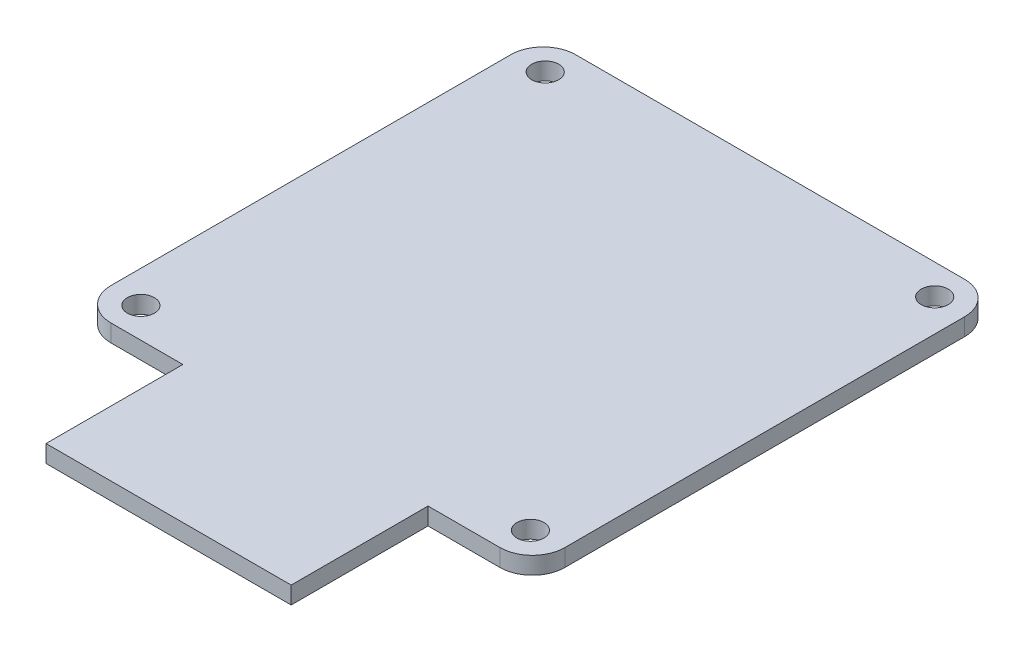
ISO-10303-21;
HEADER;
FILE_DESCRIPTION(('STEP AP214'),'2;1');
FILE_NAME('part.step','',(''),(''),'','','');
FILE_SCHEMA(('AUTOMOTIVE_DESIGN { 1 0 10303 214 1 1 1 1 }'));
ENDSEC;
DATA;
#1=APPLICATION_CONTEXT('core data for automotive mechanical design processes');
#2=APPLICATION_PROTOCOL_DEFINITION('international standard','automotive_design',2000,#1);
#3=PRODUCT_CONTEXT('',#1,'mechanical');
#4=PRODUCT('Part','Part','',(#3));
#5=PRODUCT_RELATED_PRODUCT_CATEGORY('part','',(#4));
#6=PRODUCT_DEFINITION_FORMATION('','',#4);
#7=PRODUCT_DEFINITION_CONTEXT('part definition',#1,'design');
#8=PRODUCT_DEFINITION('design','',#6,#7);
#9=PRODUCT_DEFINITION_SHAPE('','',#8);
#10=(LENGTH_UNIT() NAMED_UNIT(*) SI_UNIT(.MILLI.,.METRE.));
#11=(NAMED_UNIT(*) PLANE_ANGLE_UNIT() SI_UNIT($,.RADIAN.));
#12=(NAMED_UNIT(*) SI_UNIT($,.STERADIAN.) SOLID_ANGLE_UNIT());
#13=UNCERTAINTY_MEASURE_WITH_UNIT(LENGTH_MEASURE(1.E-05),#10,'distance_accuracy_value','');
#14=(GEOMETRIC_REPRESENTATION_CONTEXT(3) GLOBAL_UNCERTAINTY_ASSIGNED_CONTEXT((#13)) GLOBAL_UNIT_ASSIGNED_CONTEXT((#10,
#11,#12)) REPRESENTATION_CONTEXT('',''));
#15=CARTESIAN_POINT('',(0.,0.,0.));
#16=DIRECTION('',(0.,0.,1.));
#17=DIRECTION('',(1.,0.,0.));
#18=AXIS2_PLACEMENT_3D('',#15,#16,#17);
#19=CARTESIAN_POINT('',(0.,1.6,-21.5));
#20=DIRECTION('',(0.,0.,-1.));
#21=DIRECTION('',(-1.,0.,0.));
#22=AXIS2_PLACEMENT_3D('',#19,#20,#21);
#23=PLANE('',#22);
#24=DIRECTION('',(1.,0.,0.));
#25=VECTOR('',#24,1.);
#26=CARTESIAN_POINT('',(0.,0.,-21.5));
#27=LINE('',#26,#25);
#28=CARTESIAN_POINT('',(-18.,0.,-21.5));
#29=VERTEX_POINT('',#28);
#30=CARTESIAN_POINT('',(18.,0.,-21.5));
#31=VERTEX_POINT('',#30);
#32=EDGE_CURVE('E167',#29,#31,#27,.T.);
#33=ORIENTED_EDGE('',*,*,#32,.F.);
#34=DIRECTION('',(0.,-1.,0.));
#35=VECTOR('',#34,1.);
#36=CARTESIAN_POINT('',(-18.,1.6,-21.5));
#37=LINE('',#36,#35);
#38=CARTESIAN_POINT('',(-18.,1.6,-21.5));
#39=VERTEX_POINT('',#38);
#40=EDGE_CURVE('E11',#39,#29,#37,.T.);
#41=ORIENTED_EDGE('',*,*,#40,.F.);
#42=DIRECTION('',(1.,0.,0.));
#43=VECTOR('',#42,1.);
#44=CARTESIAN_POINT('',(0.,1.6,-21.5));
#45=LINE('',#44,#43);
#46=CARTESIAN_POINT('',(18.,1.6,-21.5));
#47=VERTEX_POINT('',#46);
#48=EDGE_CURVE('E440',#39,#47,#45,.T.);
#49=ORIENTED_EDGE('',*,*,#48,.T.);
#50=DIRECTION('',(0.,-1.,0.));
#51=VECTOR('',#50,1.);
#52=CARTESIAN_POINT('',(18.,1.6,-21.5));
#53=LINE('',#52,#51);
#54=EDGE_CURVE('E53',#47,#31,#53,.T.);
#55=ORIENTED_EDGE('',*,*,#54,.T.);
#56=EDGE_LOOP('',(#33,#41,#49,#55));
#57=FACE_BOUND('',#56,.T.);
#58=ADVANCED_FACE('F36',(#57),#23,.T.);
#59=CARTESIAN_POINT('',(-18.,1.6,-18.5));
#60=DIRECTION('',(0.,-1.,0.));
#61=DIRECTION('',(0.,0.,-1.));
#62=AXIS2_PLACEMENT_3D('',#59,#60,#61);
#63=CYLINDRICAL_SURFACE('',#62,3.);
#64=CARTESIAN_POINT('',(-18.,0.,-18.5));
#65=DIRECTION('',(0.,1.,0.));
#66=DIRECTION('',(0.,0.,1.));
#67=AXIS2_PLACEMENT_3D('',#64,#65,#66);
#68=CIRCLE('',#67,3.);
#69=CARTESIAN_POINT('',(-21.,0.,-18.5));
#70=VERTEX_POINT('',#69);
#71=EDGE_CURVE('E169',#29,#70,#68,.T.);
#72=ORIENTED_EDGE('',*,*,#71,.T.);
#73=DIRECTION('',(0.,-1.,0.));
#74=VECTOR('',#73,1.);
#75=CARTESIAN_POINT('',(-21.,1.6,-18.5));
#76=LINE('',#75,#74);
#77=CARTESIAN_POINT('',(-21.,1.6,-18.5));
#78=VERTEX_POINT('',#77);
#79=EDGE_CURVE('E45',#78,#70,#76,.T.);
#80=ORIENTED_EDGE('',*,*,#79,.F.);
#81=CARTESIAN_POINT('',(-18.,1.6,-18.5));
#82=DIRECTION('',(0.,1.,0.));
#83=DIRECTION('',(0.,0.,1.));
#84=AXIS2_PLACEMENT_3D('',#81,#82,#83);
#85=CIRCLE('',#84,3.);
#86=EDGE_CURVE('E438',#39,#78,#85,.T.);
#87=ORIENTED_EDGE('',*,*,#86,.F.);
#88=ORIENTED_EDGE('',*,*,#40,.T.);
#89=EDGE_LOOP('',(#72,#80,#87,#88));
#90=FACE_BOUND('',#89,.T.);
#91=ADVANCED_FACE('F226',(#90),#63,.T.);
#92=CARTESIAN_POINT('',(-21.,1.6,0.));
#93=DIRECTION('',(1.,0.,0.));
#94=DIRECTION('',(0.,0.,-1.));
#95=AXIS2_PLACEMENT_3D('',#92,#93,#94);
#96=PLANE('',#95);
#97=DIRECTION('',(0.,0.,1.));
#98=VECTOR('',#97,1.);
#99=CARTESIAN_POINT('',(-21.,0.,0.));
#100=LINE('',#99,#98);
#101=CARTESIAN_POINT('',(-21.,0.,18.5));
#102=VERTEX_POINT('',#101);
#103=EDGE_CURVE('E172',#70,#102,#100,.T.);
#104=ORIENTED_EDGE('',*,*,#103,.T.);
#105=DIRECTION('',(0.,-1.,0.));
#106=VECTOR('',#105,1.);
#107=CARTESIAN_POINT('',(-21.,1.6,18.5));
#108=LINE('',#107,#106);
#109=CARTESIAN_POINT('',(-21.,1.6,18.5));
#110=VERTEX_POINT('',#109);
#111=EDGE_CURVE('E214',#110,#102,#108,.T.);
#112=ORIENTED_EDGE('',*,*,#111,.F.);
#113=DIRECTION('',(0.,0.,1.));
#114=VECTOR('',#113,1.);
#115=CARTESIAN_POINT('',(-21.,1.6,0.));
#116=LINE('',#115,#114);
#117=EDGE_CURVE('E222',#78,#110,#116,.T.);
#118=ORIENTED_EDGE('',*,*,#117,.F.);
#119=ORIENTED_EDGE('',*,*,#79,.T.);
#120=EDGE_LOOP('',(#104,#112,#118,#119));
#121=FACE_BOUND('',#120,.T.);
#122=ADVANCED_FACE('F219',(#121),#96,.F.);
#123=CARTESIAN_POINT('',(-18.,1.6,18.5));
#124=DIRECTION('',(0.,-1.,0.));
#125=DIRECTION('',(0.,0.,-1.));
#126=AXIS2_PLACEMENT_3D('',#123,#124,#125);
#127=CYLINDRICAL_SURFACE('',#126,3.);
#128=CARTESIAN_POINT('',(-18.,0.,18.5));
#129=DIRECTION('',(0.,1.,0.));
#130=DIRECTION('',(0.,0.,1.));
#131=AXIS2_PLACEMENT_3D('',#128,#129,#130);
#132=CIRCLE('',#131,3.);
#133=CARTESIAN_POINT('',(-18.,0.,21.5));
#134=VERTEX_POINT('',#133);
#135=EDGE_CURVE('E175',#102,#134,#132,.T.);
#136=ORIENTED_EDGE('',*,*,#135,.T.);
#137=DIRECTION('',(0.,-1.,0.));
#138=VECTOR('',#137,1.);
#139=CARTESIAN_POINT('',(-18.,1.6,21.5));
#140=LINE('',#139,#138);
#141=CARTESIAN_POINT('',(-18.,1.6,21.5));
#142=VERTEX_POINT('',#141);
#143=EDGE_CURVE('E211',#142,#134,#140,.T.);
#144=ORIENTED_EDGE('',*,*,#143,.F.);
#145=CARTESIAN_POINT('',(-18.,1.6,18.5));
#146=DIRECTION('',(0.,1.,0.));
#147=DIRECTION('',(0.,0.,1.));
#148=AXIS2_PLACEMENT_3D('',#145,#146,#147);
#149=CIRCLE('',#148,3.);
#150=EDGE_CURVE('E426',#110,#142,#149,.T.);
#151=ORIENTED_EDGE('',*,*,#150,.F.);
#152=ORIENTED_EDGE('',*,*,#111,.T.);
#153=EDGE_LOOP('',(#136,#144,#151,#152));
#154=FACE_BOUND('',#153,.T.);
#155=ADVANCED_FACE('F296',(#154),#127,.T.);
#156=CARTESIAN_POINT('',(0.,1.6,21.5));
#157=DIRECTION('',(0.,0.,-1.));
#158=DIRECTION('',(-1.,0.,0.));
#159=AXIS2_PLACEMENT_3D('',#156,#157,#158);
#160=PLANE('',#159);
#161=DIRECTION('',(1.,0.,0.));
#162=VECTOR('',#161,1.);
#163=CARTESIAN_POINT('',(0.,0.,21.5));
#164=LINE('',#163,#162);
#165=CARTESIAN_POINT('',(-11.3434224779368,0.,21.5));
#166=VERTEX_POINT('',#165);
#167=EDGE_CURVE('E178',#134,#166,#164,.T.);
#168=ORIENTED_EDGE('',*,*,#167,.T.);
#169=DIRECTION('',(0.,-1.,0.));
#170=VECTOR('',#169,1.);
#171=CARTESIAN_POINT('',(-11.3434224779368,1.6,21.5));
#172=LINE('',#171,#170);
#173=CARTESIAN_POINT('',(-11.3434224779368,1.6,21.5));
#174=VERTEX_POINT('',#173);
#175=EDGE_CURVE('E208',#174,#166,#172,.T.);
#176=ORIENTED_EDGE('',*,*,#175,.F.);
#177=DIRECTION('',(1.,0.,0.));
#178=VECTOR('',#177,1.);
#179=CARTESIAN_POINT('',(0.,1.6,21.5));
#180=LINE('',#179,#178);
#181=EDGE_CURVE('E423',#142,#174,#180,.T.);
#182=ORIENTED_EDGE('',*,*,#181,.F.);
#183=ORIENTED_EDGE('',*,*,#143,.T.);
#184=EDGE_LOOP('',(#168,#176,#182,#183));
#185=FACE_BOUND('',#184,.T.);
#186=ADVANCED_FACE('F284',(#185),#160,.F.);
#187=CARTESIAN_POINT('',(-11.3434224779368,1.6,0.));
#188=DIRECTION('',(1.,0.,0.));
#189=DIRECTION('',(0.,0.,-1.));
#190=AXIS2_PLACEMENT_3D('',#187,#188,#189);
#191=PLANE('',#190);
#192=DIRECTION('',(0.,0.,1.));
#193=VECTOR('',#192,1.);
#194=CARTESIAN_POINT('',(-11.3434224779368,0.,0.));
#195=LINE('',#194,#193);
#196=CARTESIAN_POINT('',(-11.3434224779368,0.,34.1661640587151));
#197=VERTEX_POINT('',#196);
#198=EDGE_CURVE('E181',#166,#197,#195,.T.);
#199=ORIENTED_EDGE('',*,*,#198,.T.);
#200=DIRECTION('',(0.,-1.,0.));
#201=VECTOR('',#200,1.);
#202=CARTESIAN_POINT('',(-11.3434224779368,1.6,34.1661640587151));
#203=LINE('',#202,#201);
#204=CARTESIAN_POINT('',(-11.3434224779368,1.6,34.1661640587151));
#205=VERTEX_POINT('',#204);
#206=EDGE_CURVE('E205',#205,#197,#203,.T.);
#207=ORIENTED_EDGE('',*,*,#206,.F.);
#208=DIRECTION('',(0.,0.,1.));
#209=VECTOR('',#208,1.);
#210=CARTESIAN_POINT('',(-11.3434224779368,1.6,0.));
#211=LINE('',#210,#209);
#212=EDGE_CURVE('E420',#174,#205,#211,.T.);
#213=ORIENTED_EDGE('',*,*,#212,.F.);
#214=ORIENTED_EDGE('',*,*,#175,.T.);
#215=EDGE_LOOP('',(#199,#207,#213,#214));
#216=FACE_BOUND('',#215,.T.);
#217=ADVANCED_FACE('F291',(#216),#191,.F.);
#218=CARTESIAN_POINT('',(0.,1.6,34.1661640587151));
#219=DIRECTION('',(0.,0.,-1.));
#220=DIRECTION('',(-1.,0.,0.));
#221=AXIS2_PLACEMENT_3D('',#218,#219,#220);
#222=PLANE('',#221);
#223=DIRECTION('',(1.,0.,0.));
#224=VECTOR('',#223,1.);
#225=CARTESIAN_POINT('',(0.,0.,34.1661640587151));
#226=LINE('',#225,#224);
#227=CARTESIAN_POINT('',(11.3434224779368,0.,34.1661640587151));
#228=VERTEX_POINT('',#227);
#229=EDGE_CURVE('E185',#197,#228,#226,.T.);
#230=ORIENTED_EDGE('',*,*,#229,.T.);
#231=DIRECTION('',(0.,-1.,0.));
#232=VECTOR('',#231,1.);
#233=CARTESIAN_POINT('',(11.3434224779368,1.6,34.1661640587151));
#234=LINE('',#233,#232);
#235=CARTESIAN_POINT('',(11.3434224779368,1.6,34.1661640587151));
#236=VERTEX_POINT('',#235);
#237=EDGE_CURVE('E203',#236,#228,#234,.T.);
#238=ORIENTED_EDGE('',*,*,#237,.F.);
#239=DIRECTION('',(1.,0.,0.));
#240=VECTOR('',#239,1.);
#241=CARTESIAN_POINT('',(0.,1.6,34.1661640587151));
#242=LINE('',#241,#240);
#243=EDGE_CURVE('E422',#205,#236,#242,.T.);
#244=ORIENTED_EDGE('',*,*,#243,.F.);
#245=ORIENTED_EDGE('',*,*,#206,.T.);
#246=EDGE_LOOP('',(#230,#238,#244,#245));
#247=FACE_BOUND('',#246,.T.);
#248=ADVANCED_FACE('F287',(#247),#222,.F.);
#249=CARTESIAN_POINT('',(11.3434224779368,1.6,0.));
#250=DIRECTION('',(1.,0.,0.));
#251=DIRECTION('',(0.,0.,-1.));
#252=AXIS2_PLACEMENT_3D('',#249,#250,#251);
#253=PLANE('',#252);
#254=DIRECTION('',(0.,0.,1.));
#255=VECTOR('',#254,1.);
#256=CARTESIAN_POINT('',(11.3434224779368,0.,0.));
#257=LINE('',#256,#255);
#258=CARTESIAN_POINT('',(11.3434224779368,0.,21.5));
#259=VERTEX_POINT('',#258);
#260=EDGE_CURVE('E188',#259,#228,#257,.T.);
#261=ORIENTED_EDGE('',*,*,#260,.F.);
#262=DIRECTION('',(0.,-1.,0.));
#263=VECTOR('',#262,1.);
#264=CARTESIAN_POINT('',(11.3434224779368,1.6,21.5));
#265=LINE('',#264,#263);
#266=CARTESIAN_POINT('',(11.3434224779368,1.6,21.5));
#267=VERTEX_POINT('',#266);
#268=EDGE_CURVE('E201',#267,#259,#265,.T.);
#269=ORIENTED_EDGE('',*,*,#268,.F.);
#270=DIRECTION('',(0.,0.,1.));
#271=VECTOR('',#270,1.);
#272=CARTESIAN_POINT('',(11.3434224779368,1.6,0.));
#273=LINE('',#272,#271);
#274=EDGE_CURVE('E429',#267,#236,#273,.T.);
#275=ORIENTED_EDGE('',*,*,#274,.T.);
#276=ORIENTED_EDGE('',*,*,#237,.T.);
#277=EDGE_LOOP('',(#261,#269,#275,#276));
#278=FACE_BOUND('',#277,.T.);
#279=ADVANCED_FACE('F282',(#278),#253,.T.);
#280=CARTESIAN_POINT('',(18.,0.,21.5));
#281=VERTEX_POINT('',#280);
#282=EDGE_CURVE('E182',#259,#281,#164,.T.);
#283=ORIENTED_EDGE('',*,*,#282,.T.);
#284=DIRECTION('',(0.,-1.,0.));
#285=VECTOR('',#284,1.);
#286=CARTESIAN_POINT('',(18.,1.6,21.5));
#287=LINE('',#286,#285);
#288=CARTESIAN_POINT('',(18.,1.6,21.5));
#289=VERTEX_POINT('',#288);
#290=EDGE_CURVE('E147',#289,#281,#287,.T.);
#291=ORIENTED_EDGE('',*,*,#290,.F.);
#292=EDGE_CURVE('E136',#267,#289,#180,.T.);
#293=ORIENTED_EDGE('',*,*,#292,.F.);
#294=ORIENTED_EDGE('',*,*,#268,.T.);
#295=EDGE_LOOP('',(#283,#291,#293,#294));
#296=FACE_BOUND('',#295,.T.);
#297=ADVANCED_FACE('F279',(#296),#160,.F.);
#298=CARTESIAN_POINT('',(18.,1.6,18.5));
#299=DIRECTION('',(0.,-1.,0.));
#300=DIRECTION('',(0.,0.,-1.));
#301=AXIS2_PLACEMENT_3D('',#298,#299,#300);
#302=CYLINDRICAL_SURFACE('',#301,3.);
#303=CARTESIAN_POINT('',(18.,0.,18.5));
#304=DIRECTION('',(0.,1.,0.));
#305=DIRECTION('',(0.,0.,1.));
#306=AXIS2_PLACEMENT_3D('',#303,#304,#305);
#307=CIRCLE('',#306,3.);
#308=CARTESIAN_POINT('',(21.,0.,18.5));
#309=VERTEX_POINT('',#308);
#310=EDGE_CURVE('E144',#281,#309,#307,.T.);
#311=ORIENTED_EDGE('',*,*,#310,.T.);
#312=DIRECTION('',(0.,-1.,0.));
#313=VECTOR('',#312,1.);
#314=CARTESIAN_POINT('',(21.,1.6,18.5));
#315=LINE('',#314,#313);
#316=CARTESIAN_POINT('',(21.,1.6,18.5));
#317=VERTEX_POINT('',#316);
#318=EDGE_CURVE('E142',#317,#309,#315,.T.);
#319=ORIENTED_EDGE('',*,*,#318,.F.);
#320=CARTESIAN_POINT('',(18.,1.6,18.5));
#321=DIRECTION('',(0.,1.,0.));
#322=DIRECTION('',(0.,0.,1.));
#323=AXIS2_PLACEMENT_3D('',#320,#321,#322);
#324=CIRCLE('',#323,3.);
#325=EDGE_CURVE('E127',#289,#317,#324,.T.);
#326=ORIENTED_EDGE('',*,*,#325,.F.);
#327=ORIENTED_EDGE('',*,*,#290,.T.);
#328=EDGE_LOOP('',(#311,#319,#326,#327));
#329=FACE_BOUND('',#328,.T.);
#330=ADVANCED_FACE('F143',(#329),#302,.T.);
#331=CARTESIAN_POINT('',(21.,1.6,0.));
#332=DIRECTION('',(1.,0.,0.));
#333=DIRECTION('',(0.,0.,-1.));
#334=AXIS2_PLACEMENT_3D('',#331,#332,#333);
#335=PLANE('',#334);
#336=DIRECTION('',(0.,0.,1.));
#337=VECTOR('',#336,1.);
#338=CARTESIAN_POINT('',(21.,0.,0.));
#339=LINE('',#338,#337);
#340=CARTESIAN_POINT('',(21.,0.,-18.5));
#341=VERTEX_POINT('',#340);
#342=EDGE_CURVE('E192',#341,#309,#339,.T.);
#343=ORIENTED_EDGE('',*,*,#342,.F.);
#344=DIRECTION('',(0.,-1.,0.));
#345=VECTOR('',#344,1.);
#346=CARTESIAN_POINT('',(21.,1.6,-18.5));
#347=LINE('',#346,#345);
#348=CARTESIAN_POINT('',(21.,1.6,-18.5));
#349=VERTEX_POINT('',#348);
#350=EDGE_CURVE('E90',#349,#341,#347,.T.);
#351=ORIENTED_EDGE('',*,*,#350,.F.);
#352=DIRECTION('',(0.,0.,1.));
#353=VECTOR('',#352,1.);
#354=CARTESIAN_POINT('',(21.,1.6,0.));
#355=LINE('',#354,#353);
#356=EDGE_CURVE('E133',#349,#317,#355,.T.);
#357=ORIENTED_EDGE('',*,*,#356,.T.);
#358=ORIENTED_EDGE('',*,*,#318,.T.);
#359=EDGE_LOOP('',(#343,#351,#357,#358));
#360=FACE_BOUND('',#359,.T.);
#361=ADVANCED_FACE('F149',(#360),#335,.T.);
#362=CARTESIAN_POINT('',(-18.0215,1.6,18.707));
#363=DIRECTION('',(0.,-1.,0.));
#364=DIRECTION('',(0.,0.,-1.));
#365=AXIS2_PLACEMENT_3D('',#362,#363,#364);
#366=CYLINDRICAL_SURFACE('',#365,1.25);
#367=CARTESIAN_POINT('',(-18.0215,1.6,18.707));
#368=DIRECTION('',(0.,1.,0.));
#369=DIRECTION('',(0.,0.,1.));
#370=AXIS2_PLACEMENT_3D('',#367,#368,#369);
#371=CIRCLE('',#370,1.25);
#372=CARTESIAN_POINT('',(-18.0215,1.6,19.957));
#373=VERTEX_POINT('',#372);
#374=EDGE_CURVE('E442',#373,#373,#371,.T.);
#375=ORIENTED_EDGE('',*,*,#374,.T.);
#376=EDGE_LOOP('',(#375));
#377=FACE_BOUND('',#376,.T.);
#378=CARTESIAN_POINT('',(-18.0215,0.,18.707));
#379=DIRECTION('',(0.,1.,0.));
#380=DIRECTION('',(0.,0.,1.));
#381=AXIS2_PLACEMENT_3D('',#378,#379,#380);
#382=CIRCLE('',#381,1.25);
#383=CARTESIAN_POINT('',(-18.0215,0.,19.957));
#384=VERTEX_POINT('',#383);
#385=EDGE_CURVE('E164',#384,#384,#382,.T.);
#386=ORIENTED_EDGE('',*,*,#385,.F.);
#387=EDGE_LOOP('',(#386));
#388=FACE_BOUND('',#387,.T.);
#389=ADVANCED_FACE('F237',(#377,#388),#366,.F.);
#390=CARTESIAN_POINT('',(18.0215,1.6,18.707));
#391=DIRECTION('',(0.,-1.,0.));
#392=DIRECTION('',(0.,0.,-1.));
#393=AXIS2_PLACEMENT_3D('',#390,#391,#392);
#394=CYLINDRICAL_SURFACE('',#393,1.25);
#395=CARTESIAN_POINT('',(18.0215,1.6,18.707));
#396=DIRECTION('',(0.,1.,0.));
#397=DIRECTION('',(0.,0.,1.));
#398=AXIS2_PLACEMENT_3D('',#395,#396,#397);
#399=CIRCLE('',#398,1.25);
#400=CARTESIAN_POINT('',(18.0215,1.6,19.957));
#401=VERTEX_POINT('',#400);
#402=EDGE_CURVE('E445',#401,#401,#399,.T.);
#403=ORIENTED_EDGE('',*,*,#402,.T.);
#404=EDGE_LOOP('',(#403));
#405=FACE_BOUND('',#404,.T.);
#406=CARTESIAN_POINT('',(18.0215,0.,18.707));
#407=DIRECTION('',(0.,1.,0.));
#408=DIRECTION('',(0.,0.,1.));
#409=AXIS2_PLACEMENT_3D('',#406,#407,#408);
#410=CIRCLE('',#409,1.25);
#411=CARTESIAN_POINT('',(18.0215,0.,19.957));
#412=VERTEX_POINT('',#411);
#413=EDGE_CURVE('E161',#412,#412,#410,.T.);
#414=ORIENTED_EDGE('',*,*,#413,.F.);
#415=EDGE_LOOP('',(#414));
#416=FACE_BOUND('',#415,.T.);
#417=ADVANCED_FACE('F240',(#405,#416),#394,.F.);
#418=CARTESIAN_POINT('',(18.0215,1.6,-18.707));
#419=DIRECTION('',(0.,-1.,0.));
#420=DIRECTION('',(0.,0.,-1.));
#421=AXIS2_PLACEMENT_3D('',#418,#419,#420);
#422=CYLINDRICAL_SURFACE('',#421,1.25);
#423=CARTESIAN_POINT('',(18.0215,1.6,-18.707));
#424=DIRECTION('',(0.,1.,0.));
#425=DIRECTION('',(0.,0.,1.));
#426=AXIS2_PLACEMENT_3D('',#423,#424,#425);
#427=CIRCLE('',#426,1.25);
#428=CARTESIAN_POINT('',(18.0215,1.6,-17.457));
#429=VERTEX_POINT('',#428);
#430=EDGE_CURVE('E255',#429,#429,#427,.T.);
#431=ORIENTED_EDGE('',*,*,#430,.T.);
#432=EDGE_LOOP('',(#431));
#433=FACE_BOUND('',#432,.T.);
#434=CARTESIAN_POINT('',(18.0215,0.,-18.707));
#435=DIRECTION('',(0.,1.,0.));
#436=DIRECTION('',(0.,0.,1.));
#437=AXIS2_PLACEMENT_3D('',#434,#435,#436);
#438=CIRCLE('',#437,1.25);
#439=CARTESIAN_POINT('',(18.0215,0.,-17.457));
#440=VERTEX_POINT('',#439);
#441=EDGE_CURVE('E158',#440,#440,#438,.T.);
#442=ORIENTED_EDGE('',*,*,#441,.F.);
#443=EDGE_LOOP('',(#442));
#444=FACE_BOUND('',#443,.T.);
#445=ADVANCED_FACE('F243',(#433,#444),#422,.F.);
#446=CARTESIAN_POINT('',(-18.0215,1.6,-18.707));
#447=DIRECTION('',(0.,-1.,0.));
#448=DIRECTION('',(0.,0.,-1.));
#449=AXIS2_PLACEMENT_3D('',#446,#447,#448);
#450=CYLINDRICAL_SURFACE('',#449,1.25);
#451=CARTESIAN_POINT('',(-18.0215,1.6,-18.707));
#452=DIRECTION('',(0.,1.,0.));
#453=DIRECTION('',(0.,0.,1.));
#454=AXIS2_PLACEMENT_3D('',#451,#452,#453);
#455=CIRCLE('',#454,1.25);
#456=CARTESIAN_POINT('',(-18.0215,1.6,-17.457));
#457=VERTEX_POINT('',#456);
#458=EDGE_CURVE('E197',#457,#457,#455,.T.);
#459=ORIENTED_EDGE('',*,*,#458,.T.);
#460=EDGE_LOOP('',(#459));
#461=FACE_BOUND('',#460,.T.);
#462=CARTESIAN_POINT('',(-18.0215,0.,-18.707));
#463=DIRECTION('',(0.,1.,0.));
#464=DIRECTION('',(0.,0.,1.));
#465=AXIS2_PLACEMENT_3D('',#462,#463,#464);
#466=CIRCLE('',#465,1.25);
#467=CARTESIAN_POINT('',(-18.0215,0.,-17.457));
#468=VERTEX_POINT('',#467);
#469=EDGE_CURVE('E155',#468,#468,#466,.T.);
#470=ORIENTED_EDGE('',*,*,#469,.F.);
#471=EDGE_LOOP('',(#470));
#472=FACE_BOUND('',#471,.T.);
#473=ADVANCED_FACE('F38',(#461,#472),#450,.F.);
#474=CARTESIAN_POINT('',(18.,1.6,-18.5));
#475=DIRECTION('',(0.,-1.,0.));
#476=DIRECTION('',(0.,0.,-1.));
#477=AXIS2_PLACEMENT_3D('',#474,#475,#476);
#478=CYLINDRICAL_SURFACE('',#477,3.);
#479=CARTESIAN_POINT('',(18.,0.,-18.5));
#480=DIRECTION('',(0.,1.,0.));
#481=DIRECTION('',(0.,0.,1.));
#482=AXIS2_PLACEMENT_3D('',#479,#480,#481);
#483=CIRCLE('',#482,3.);
#484=EDGE_CURVE('E194',#31,#341,#483,.F.);
#485=ORIENTED_EDGE('',*,*,#484,.F.);
#486=ORIENTED_EDGE('',*,*,#54,.F.);
#487=CARTESIAN_POINT('',(18.,1.6,-18.5));
#488=DIRECTION('',(0.,1.,0.));
#489=DIRECTION('',(0.,0.,1.));
#490=AXIS2_PLACEMENT_3D('',#487,#488,#489);
#491=CIRCLE('',#490,3.);
#492=EDGE_CURVE('E150',#47,#349,#491,.F.);
#493=ORIENTED_EDGE('',*,*,#492,.T.);
#494=ORIENTED_EDGE('',*,*,#350,.T.);
#495=EDGE_LOOP('',(#485,#486,#493,#494));
#496=FACE_BOUND('',#495,.T.);
#497=ADVANCED_FACE('F250',(#496),#478,.T.);
#498=CARTESIAN_POINT('',(0.,1.6,0.));
#499=DIRECTION('',(0.,1.,0.));
#500=DIRECTION('',(0.,0.,1.));
#501=AXIS2_PLACEMENT_3D('',#498,#499,#500);
#502=PLANE('',#501);
#503=ORIENTED_EDGE('',*,*,#458,.F.);
#504=EDGE_LOOP('',(#503));
#505=FACE_BOUND('',#504,.T.);
#506=ORIENTED_EDGE('',*,*,#430,.F.);
#507=EDGE_LOOP('',(#506));
#508=FACE_BOUND('',#507,.T.);
#509=ORIENTED_EDGE('',*,*,#402,.F.);
#510=EDGE_LOOP('',(#509));
#511=FACE_BOUND('',#510,.T.);
#512=ORIENTED_EDGE('',*,*,#374,.F.);
#513=EDGE_LOOP('',(#512));
#514=FACE_BOUND('',#513,.T.);
#515=ORIENTED_EDGE('',*,*,#48,.F.);
#516=ORIENTED_EDGE('',*,*,#86,.T.);
#517=ORIENTED_EDGE('',*,*,#117,.T.);
#518=ORIENTED_EDGE('',*,*,#150,.T.);
#519=ORIENTED_EDGE('',*,*,#181,.T.);
#520=ORIENTED_EDGE('',*,*,#212,.T.);
#521=ORIENTED_EDGE('',*,*,#243,.T.);
#522=ORIENTED_EDGE('',*,*,#274,.F.);
#523=ORIENTED_EDGE('',*,*,#292,.T.);
#524=ORIENTED_EDGE('',*,*,#325,.T.);
#525=ORIENTED_EDGE('',*,*,#356,.F.);
#526=ORIENTED_EDGE('',*,*,#492,.F.);
#527=EDGE_LOOP('',(#515,#516,#517,#518,#519,#520,#521,#522,#523,#524,#525,#526));
#528=FACE_BOUND('',#527,.T.);
#529=ADVANCED_FACE('F130',(#505,#508,#511,#514,#528),#502,.T.);
#530=CARTESIAN_POINT('',(0.,0.,0.));
#531=DIRECTION('',(0.,1.,0.));
#532=DIRECTION('',(0.,0.,1.));
#533=AXIS2_PLACEMENT_3D('',#530,#531,#532);
#534=PLANE('',#533);
#535=ORIENTED_EDGE('',*,*,#469,.T.);
#536=EDGE_LOOP('',(#535));
#537=FACE_BOUND('',#536,.T.);
#538=ORIENTED_EDGE('',*,*,#441,.T.);
#539=EDGE_LOOP('',(#538));
#540=FACE_BOUND('',#539,.T.);
#541=ORIENTED_EDGE('',*,*,#413,.T.);
#542=EDGE_LOOP('',(#541));
#543=FACE_BOUND('',#542,.T.);
#544=ORIENTED_EDGE('',*,*,#385,.T.);
#545=EDGE_LOOP('',(#544));
#546=FACE_BOUND('',#545,.T.);
#547=ORIENTED_EDGE('',*,*,#32,.T.);
#548=ORIENTED_EDGE('',*,*,#484,.T.);
#549=ORIENTED_EDGE('',*,*,#342,.T.);
#550=ORIENTED_EDGE('',*,*,#310,.F.);
#551=ORIENTED_EDGE('',*,*,#282,.F.);
#552=ORIENTED_EDGE('',*,*,#260,.T.);
#553=ORIENTED_EDGE('',*,*,#229,.F.);
#554=ORIENTED_EDGE('',*,*,#198,.F.);
#555=ORIENTED_EDGE('',*,*,#167,.F.);
#556=ORIENTED_EDGE('',*,*,#135,.F.);
#557=ORIENTED_EDGE('',*,*,#103,.F.);
#558=ORIENTED_EDGE('',*,*,#71,.F.);
#559=EDGE_LOOP('',(#547,#548,#549,#550,#551,#552,#553,#554,#555,#556,#557,#558));
#560=FACE_BOUND('',#559,.T.);
#561=ADVANCED_FACE('F228',(#537,#540,#543,#546,#560),#534,.F.);
#562=CLOSED_SHELL('',(#58,#91,#122,#155,#186,#217,#248,#279,#297,#330,#361,#389,#417,#445,#473,
#497,#529,#561));
#563=MANIFOLD_SOLID_BREP('B2',#562);
#564=ADVANCED_BREP_SHAPE_REPRESENTATION('',(#18,#563),#14);
#565=SHAPE_DEFINITION_REPRESENTATION(#9,#564);
ENDSEC;
END-ISO-10303-21;
